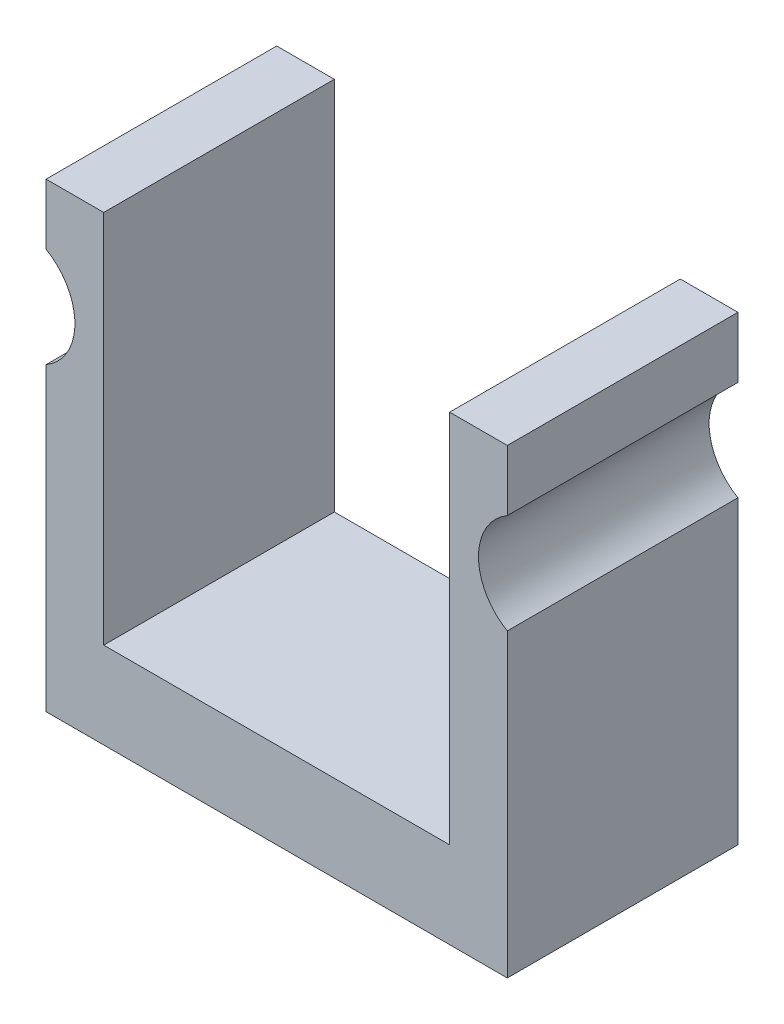
ISO-10303-21;
HEADER;
FILE_DESCRIPTION(('STEP AP214'),'2;1');
FILE_NAME('part.step','',(''),(''),'','','');
FILE_SCHEMA(('AUTOMOTIVE_DESIGN { 1 0 10303 214 1 1 1 1 }'));
ENDSEC;
DATA;
#1=APPLICATION_CONTEXT('core data for automotive mechanical design processes');
#2=APPLICATION_PROTOCOL_DEFINITION('international standard','automotive_design',2000,#1);
#3=PRODUCT_CONTEXT('',#1,'mechanical');
#4=PRODUCT('Part','Part','',(#3));
#5=PRODUCT_RELATED_PRODUCT_CATEGORY('part','',(#4));
#6=PRODUCT_DEFINITION_FORMATION('','',#4);
#7=PRODUCT_DEFINITION_CONTEXT('part definition',#1,'design');
#8=PRODUCT_DEFINITION('design','',#6,#7);
#9=PRODUCT_DEFINITION_SHAPE('','',#8);
#10=(LENGTH_UNIT() NAMED_UNIT(*) SI_UNIT(.MILLI.,.METRE.));
#11=(NAMED_UNIT(*) PLANE_ANGLE_UNIT() SI_UNIT($,.RADIAN.));
#12=(NAMED_UNIT(*) SI_UNIT($,.STERADIAN.) SOLID_ANGLE_UNIT());
#13=UNCERTAINTY_MEASURE_WITH_UNIT(LENGTH_MEASURE(1.E-05),#10,'distance_accuracy_value','');
#14=(GEOMETRIC_REPRESENTATION_CONTEXT(3) GLOBAL_UNCERTAINTY_ASSIGNED_CONTEXT((#13)) GLOBAL_UNIT_ASSIGNED_CONTEXT((#10,
#11,#12)) REPRESENTATION_CONTEXT('',''));
#15=CARTESIAN_POINT('',(0.,0.,0.));
#16=DIRECTION('',(0.,0.,1.));
#17=DIRECTION('',(1.,0.,0.));
#18=AXIS2_PLACEMENT_3D('',#15,#16,#17);
#19=CARTESIAN_POINT('',(16.7574956918045,-19.3746351202378,25.4));
#20=DIRECTION('',(-1.,0.,0.));
#21=DIRECTION('',(0.,0.,1.));
#22=AXIS2_PLACEMENT_3D('',#19,#20,#21);
#23=PLANE('',#22);
#24=DIRECTION('',(0.,1.,0.));
#25=VECTOR('',#24,1.);
#26=CARTESIAN_POINT('',(16.7574956918045,-19.3746351202378,0.));
#27=LINE('',#26,#25);
#28=CARTESIAN_POINT('',(16.7574956918045,-19.3746351202378,0.));
#29=VERTEX_POINT('',#28);
#30=CARTESIAN_POINT('',(16.7574956918045,13.734103565731,0.));
#31=VERTEX_POINT('',#30);
#32=EDGE_CURVE('E141',#29,#31,#27,.T.);
#33=ORIENTED_EDGE('',*,*,#32,.T.);
#34=DIRECTION('',(0.,0.,1.));
#35=VECTOR('',#34,1.);
#36=CARTESIAN_POINT('',(16.7574956918045,13.734103565731,0.));
#37=LINE('',#36,#35);
#38=CARTESIAN_POINT('',(16.7574956918045,13.734103565731,25.4));
#39=VERTEX_POINT('',#38);
#40=EDGE_CURVE('E48',#31,#39,#37,.T.);
#41=ORIENTED_EDGE('',*,*,#40,.T.);
#42=DIRECTION('',(0.,1.,0.));
#43=VECTOR('',#42,1.);
#44=CARTESIAN_POINT('',(16.7574956918045,-19.3746351202378,25.4));
#45=LINE('',#44,#43);
#46=CARTESIAN_POINT('',(16.7574956918045,-19.3746351202378,25.4));
#47=VERTEX_POINT('',#46);
#48=EDGE_CURVE('E195',#47,#39,#45,.T.);
#49=ORIENTED_EDGE('',*,*,#48,.F.);
#50=DIRECTION('',(0.,0.,-1.));
#51=VECTOR('',#50,1.);
#52=CARTESIAN_POINT('',(16.7574956918045,-19.3746351202378,25.4));
#53=LINE('',#52,#51);
#54=EDGE_CURVE('E176',#47,#29,#53,.T.);
#55=ORIENTED_EDGE('',*,*,#54,.T.);
#56=EDGE_LOOP('',(#33,#41,#49,#55));
#57=FACE_BOUND('',#56,.T.);
#58=ADVANCED_FACE('F33',(#57),#23,.F.);
#59=CARTESIAN_POINT('',(-34.0425043081955,-19.3746351202378,25.4));
#60=DIRECTION('',(1.,0.,0.));
#61=DIRECTION('',(0.,0.,-1.));
#62=AXIS2_PLACEMENT_3D('',#59,#60,#61);
#63=PLANE('',#62);
#64=DIRECTION('',(0.,-1.,0.));
#65=VECTOR('',#64,1.);
#66=CARTESIAN_POINT('',(-34.0425043081955,-19.3746351202378,0.));
#67=LINE('',#66,#65);
#68=CARTESIAN_POINT('',(-34.0425043081955,31.4253648797621,0.));
#69=VERTEX_POINT('',#68);
#70=CARTESIAN_POINT('',(-34.0425043081955,24.7326261937933,0.));
#71=VERTEX_POINT('',#70);
#72=EDGE_CURVE('E144',#69,#71,#67,.T.);
#73=ORIENTED_EDGE('',*,*,#72,.T.);
#74=DIRECTION('',(0.,0.,1.));
#75=VECTOR('',#74,1.);
#76=CARTESIAN_POINT('',(-34.0425043081955,24.7326261937933,0.));
#77=LINE('',#76,#75);
#78=CARTESIAN_POINT('',(-34.0425043081955,24.7326261937933,25.4));
#79=VERTEX_POINT('',#78);
#80=EDGE_CURVE('E55',#71,#79,#77,.T.);
#81=ORIENTED_EDGE('',*,*,#80,.T.);
#82=DIRECTION('',(0.,-1.,0.));
#83=VECTOR('',#82,1.);
#84=CARTESIAN_POINT('',(-34.0425043081955,-19.3746351202378,25.4));
#85=LINE('',#84,#83);
#86=CARTESIAN_POINT('',(-34.0425043081955,31.4253648797621,25.4));
#87=VERTEX_POINT('',#86);
#88=EDGE_CURVE('E223',#87,#79,#85,.T.);
#89=ORIENTED_EDGE('',*,*,#88,.F.);
#90=DIRECTION('',(0.,0.,-1.));
#91=VECTOR('',#90,1.);
#92=CARTESIAN_POINT('',(-34.0425043081955,31.4253648797621,25.4));
#93=LINE('',#92,#91);
#94=EDGE_CURVE('E158',#87,#69,#93,.T.);
#95=ORIENTED_EDGE('',*,*,#94,.T.);
#96=EDGE_LOOP('',(#73,#81,#89,#95));
#97=FACE_BOUND('',#96,.T.);
#98=ADVANCED_FACE('F212',(#97),#63,.F.);
#99=CARTESIAN_POINT('',(-34.0425043081955,13.734103565731,25.4));
#100=VERTEX_POINT('',#99);
#101=CARTESIAN_POINT('',(-34.0425043081955,-19.3746351202378,25.4));
#102=VERTEX_POINT('',#101);
#103=EDGE_CURVE('E157',#100,#102,#85,.T.);
#104=ORIENTED_EDGE('',*,*,#103,.F.);
#105=DIRECTION('',(0.,0.,1.));
#106=VECTOR('',#105,1.);
#107=CARTESIAN_POINT('',(-34.0425043081955,13.734103565731,0.));
#108=LINE('',#107,#106);
#109=CARTESIAN_POINT('',(-34.0425043081955,13.734103565731,0.));
#110=VERTEX_POINT('',#109);
#111=EDGE_CURVE('E191',#100,#110,#108,.F.);
#112=ORIENTED_EDGE('',*,*,#111,.T.);
#113=CARTESIAN_POINT('',(-34.0425043081955,-19.3746351202378,0.));
#114=VERTEX_POINT('',#113);
#115=EDGE_CURVE('E190',#110,#114,#67,.T.);
#116=ORIENTED_EDGE('',*,*,#115,.T.);
#117=DIRECTION('',(0.,0.,-1.));
#118=VECTOR('',#117,1.);
#119=CARTESIAN_POINT('',(-34.0425043081955,-19.3746351202378,25.4));
#120=LINE('',#119,#118);
#121=EDGE_CURVE('E41',#102,#114,#120,.T.);
#122=ORIENTED_EDGE('',*,*,#121,.F.);
#123=EDGE_LOOP('',(#104,#112,#116,#122));
#124=FACE_BOUND('',#123,.T.);
#125=ADVANCED_FACE('F35',(#124),#63,.F.);
#126=CARTESIAN_POINT('',(-34.0425043081955,-19.3746351202378,25.4));
#127=DIRECTION('',(0.,1.,0.));
#128=DIRECTION('',(0.,0.,1.));
#129=AXIS2_PLACEMENT_3D('',#126,#127,#128);
#130=PLANE('',#129);
#131=DIRECTION('',(1.,0.,0.));
#132=VECTOR('',#131,1.);
#133=CARTESIAN_POINT('',(-34.0425043081955,-19.3746351202378,0.));
#134=LINE('',#133,#132);
#135=EDGE_CURVE('E142',#114,#29,#134,.T.);
#136=ORIENTED_EDGE('',*,*,#135,.T.);
#137=ORIENTED_EDGE('',*,*,#54,.F.);
#138=DIRECTION('',(1.,0.,0.));
#139=VECTOR('',#138,1.);
#140=CARTESIAN_POINT('',(-34.0425043081955,-19.3746351202378,25.4));
#141=LINE('',#140,#139);
#142=EDGE_CURVE('E185',#102,#47,#141,.T.);
#143=ORIENTED_EDGE('',*,*,#142,.F.);
#144=ORIENTED_EDGE('',*,*,#121,.T.);
#145=EDGE_LOOP('',(#136,#137,#143,#144));
#146=FACE_BOUND('',#145,.T.);
#147=ADVANCED_FACE('F182',(#146),#130,.F.);
#148=CARTESIAN_POINT('',(16.7574956918045,24.7326261937933,25.4));
#149=VERTEX_POINT('',#148);
#150=CARTESIAN_POINT('',(16.7574956918045,31.4253648797621,25.4));
#151=VERTEX_POINT('',#150);
#152=EDGE_CURVE('E135',#149,#151,#45,.T.);
#153=ORIENTED_EDGE('',*,*,#152,.F.);
#154=DIRECTION('',(0.,0.,1.));
#155=VECTOR('',#154,1.);
#156=CARTESIAN_POINT('',(16.7574956918045,24.7326261937933,0.));
#157=LINE('',#156,#155);
#158=CARTESIAN_POINT('',(16.7574956918045,24.7326261937933,0.));
#159=VERTEX_POINT('',#158);
#160=EDGE_CURVE('E121',#149,#159,#157,.F.);
#161=ORIENTED_EDGE('',*,*,#160,.T.);
#162=CARTESIAN_POINT('',(16.7574956918045,31.4253648797621,0.));
#163=VERTEX_POINT('',#162);
#164=EDGE_CURVE('E133',#159,#163,#27,.T.);
#165=ORIENTED_EDGE('',*,*,#164,.T.);
#166=DIRECTION('',(0.,0.,-1.));
#167=VECTOR('',#166,1.);
#168=CARTESIAN_POINT('',(16.7574956918045,31.4253648797621,25.4));
#169=LINE('',#168,#167);
#170=EDGE_CURVE('E174',#151,#163,#169,.T.);
#171=ORIENTED_EDGE('',*,*,#170,.F.);
#172=EDGE_LOOP('',(#153,#161,#165,#171));
#173=FACE_BOUND('',#172,.T.);
#174=ADVANCED_FACE('F131',(#173),#23,.F.);
#175=CARTESIAN_POINT('',(16.7574956918045,31.4253648797621,25.4));
#176=DIRECTION('',(0.,-1.,0.));
#177=DIRECTION('',(0.,0.,-1.));
#178=AXIS2_PLACEMENT_3D('',#175,#176,#177);
#179=PLANE('',#178);
#180=DIRECTION('',(-1.,0.,0.));
#181=VECTOR('',#180,1.);
#182=CARTESIAN_POINT('',(16.7574956918045,31.4253648797621,0.));
#183=LINE('',#182,#181);
#184=CARTESIAN_POINT('',(10.4074956918045,31.4253648797621,0.));
#185=VERTEX_POINT('',#184);
#186=EDGE_CURVE('E140',#163,#185,#183,.T.);
#187=ORIENTED_EDGE('',*,*,#186,.T.);
#188=DIRECTION('',(0.,0.,-1.));
#189=VECTOR('',#188,1.);
#190=CARTESIAN_POINT('',(10.4074956918045,31.4253648797621,25.4));
#191=LINE('',#190,#189);
#192=CARTESIAN_POINT('',(10.4074956918045,31.4253648797621,25.4));
#193=VERTEX_POINT('',#192);
#194=EDGE_CURVE('E171',#193,#185,#191,.T.);
#195=ORIENTED_EDGE('',*,*,#194,.F.);
#196=DIRECTION('',(-1.,0.,0.));
#197=VECTOR('',#196,1.);
#198=CARTESIAN_POINT('',(16.7574956918045,31.4253648797621,25.4));
#199=LINE('',#198,#197);
#200=EDGE_CURVE('E197',#151,#193,#199,.T.);
#201=ORIENTED_EDGE('',*,*,#200,.F.);
#202=ORIENTED_EDGE('',*,*,#170,.T.);
#203=EDGE_LOOP('',(#187,#195,#201,#202));
#204=FACE_BOUND('',#203,.T.);
#205=ADVANCED_FACE('F231',(#204),#179,.F.);
#206=CARTESIAN_POINT('',(10.4074956918045,31.4253648797621,25.4));
#207=DIRECTION('',(1.,0.,0.));
#208=DIRECTION('',(0.,1.,0.));
#209=AXIS2_PLACEMENT_3D('',#206,#207,#208);
#210=PLANE('',#209);
#211=DIRECTION('',(0.,-1.,0.));
#212=VECTOR('',#211,1.);
#213=CARTESIAN_POINT('',(10.4074956918045,31.4253648797621,0.));
#214=LINE('',#213,#212);
#215=CARTESIAN_POINT('',(10.4074956918045,-9.84963512023785,0.));
#216=VERTEX_POINT('',#215);
#217=EDGE_CURVE('E149',#185,#216,#214,.T.);
#218=ORIENTED_EDGE('',*,*,#217,.T.);
#219=DIRECTION('',(0.,0.,-1.));
#220=VECTOR('',#219,1.);
#221=CARTESIAN_POINT('',(10.4074956918045,-9.84963512023785,25.4));
#222=LINE('',#221,#220);
#223=CARTESIAN_POINT('',(10.4074956918045,-9.84963512023785,25.4));
#224=VERTEX_POINT('',#223);
#225=EDGE_CURVE('E168',#224,#216,#222,.T.);
#226=ORIENTED_EDGE('',*,*,#225,.F.);
#227=DIRECTION('',(0.,-1.,0.));
#228=VECTOR('',#227,1.);
#229=CARTESIAN_POINT('',(10.4074956918045,31.4253648797621,25.4));
#230=LINE('',#229,#228);
#231=EDGE_CURVE('E199',#193,#224,#230,.T.);
#232=ORIENTED_EDGE('',*,*,#231,.F.);
#233=ORIENTED_EDGE('',*,*,#194,.T.);
#234=EDGE_LOOP('',(#218,#226,#232,#233));
#235=FACE_BOUND('',#234,.T.);
#236=ADVANCED_FACE('F235',(#235),#210,.F.);
#237=CARTESIAN_POINT('',(10.4074956918045,-9.84963512023785,25.4));
#238=DIRECTION('',(0.,-1.,0.));
#239=DIRECTION('',(1.,0.,0.));
#240=AXIS2_PLACEMENT_3D('',#237,#238,#239);
#241=PLANE('',#240);
#242=DIRECTION('',(-1.,0.,0.));
#243=VECTOR('',#242,1.);
#244=CARTESIAN_POINT('',(10.4074956918045,-9.84963512023785,0.));
#245=LINE('',#244,#243);
#246=CARTESIAN_POINT('',(-27.6925043081955,-9.84963512023785,0.));
#247=VERTEX_POINT('',#246);
#248=EDGE_CURVE('E151',#216,#247,#245,.T.);
#249=ORIENTED_EDGE('',*,*,#248,.T.);
#250=DIRECTION('',(0.,0.,-1.));
#251=VECTOR('',#250,1.);
#252=CARTESIAN_POINT('',(-27.6925043081955,-9.84963512023785,25.4));
#253=LINE('',#252,#251);
#254=CARTESIAN_POINT('',(-27.6925043081955,-9.84963512023785,25.4));
#255=VERTEX_POINT('',#254);
#256=EDGE_CURVE('E165',#255,#247,#253,.T.);
#257=ORIENTED_EDGE('',*,*,#256,.F.);
#258=DIRECTION('',(-1.,0.,0.));
#259=VECTOR('',#258,1.);
#260=CARTESIAN_POINT('',(10.4074956918045,-9.84963512023785,25.4));
#261=LINE('',#260,#259);
#262=EDGE_CURVE('E205',#224,#255,#261,.T.);
#263=ORIENTED_EDGE('',*,*,#262,.F.);
#264=ORIENTED_EDGE('',*,*,#225,.T.);
#265=EDGE_LOOP('',(#249,#257,#263,#264));
#266=FACE_BOUND('',#265,.T.);
#267=ADVANCED_FACE('F241',(#266),#241,.F.);
#268=CARTESIAN_POINT('',(-27.6925043081955,-9.84963512023785,25.4));
#269=DIRECTION('',(-1.,0.,0.));
#270=DIRECTION('',(0.,0.,1.));
#271=AXIS2_PLACEMENT_3D('',#268,#269,#270);
#272=PLANE('',#271);
#273=DIRECTION('',(0.,1.,0.));
#274=VECTOR('',#273,1.);
#275=CARTESIAN_POINT('',(-27.6925043081955,-9.84963512023785,0.));
#276=LINE('',#275,#274);
#277=CARTESIAN_POINT('',(-27.6925043081955,31.4253648797621,0.));
#278=VERTEX_POINT('',#277);
#279=EDGE_CURVE('E153',#247,#278,#276,.T.);
#280=ORIENTED_EDGE('',*,*,#279,.T.);
#281=DIRECTION('',(0.,0.,-1.));
#282=VECTOR('',#281,1.);
#283=CARTESIAN_POINT('',(-27.6925043081955,31.4253648797621,25.4));
#284=LINE('',#283,#282);
#285=CARTESIAN_POINT('',(-27.6925043081955,31.4253648797621,25.4));
#286=VERTEX_POINT('',#285);
#287=EDGE_CURVE('E161',#286,#278,#284,.T.);
#288=ORIENTED_EDGE('',*,*,#287,.F.);
#289=DIRECTION('',(0.,1.,0.));
#290=VECTOR('',#289,1.);
#291=CARTESIAN_POINT('',(-27.6925043081955,-9.84963512023785,25.4));
#292=LINE('',#291,#290);
#293=EDGE_CURVE('E207',#255,#286,#292,.T.);
#294=ORIENTED_EDGE('',*,*,#293,.F.);
#295=ORIENTED_EDGE('',*,*,#256,.T.);
#296=EDGE_LOOP('',(#280,#288,#294,#295));
#297=FACE_BOUND('',#296,.T.);
#298=ADVANCED_FACE('F244',(#297),#272,.F.);
#299=CARTESIAN_POINT('',(-34.0425043081955,31.4253648797621,25.4));
#300=DIRECTION('',(0.,-1.,0.));
#301=DIRECTION('',(0.,0.,-1.));
#302=AXIS2_PLACEMENT_3D('',#299,#300,#301);
#303=PLANE('',#302);
#304=DIRECTION('',(-1.,0.,0.));
#305=VECTOR('',#304,1.);
#306=CARTESIAN_POINT('',(-34.0425043081955,31.4253648797621,0.));
#307=LINE('',#306,#305);
#308=EDGE_CURVE('E155',#278,#69,#307,.T.);
#309=ORIENTED_EDGE('',*,*,#308,.T.);
#310=ORIENTED_EDGE('',*,*,#94,.F.);
#311=DIRECTION('',(-1.,0.,0.));
#312=VECTOR('',#311,1.);
#313=CARTESIAN_POINT('',(-34.0425043081955,31.4253648797621,25.4));
#314=LINE('',#313,#312);
#315=EDGE_CURVE('E162',#286,#87,#314,.T.);
#316=ORIENTED_EDGE('',*,*,#315,.F.);
#317=ORIENTED_EDGE('',*,*,#287,.T.);
#318=EDGE_LOOP('',(#309,#310,#316,#317));
#319=FACE_BOUND('',#318,.T.);
#320=ADVANCED_FACE('F247',(#319),#303,.F.);
#321=CARTESIAN_POINT('',(-34.0425043081955,31.4253648797621,25.4));
#322=DIRECTION('',(0.,0.,-1.));
#323=DIRECTION('',(-1.,0.,0.));
#324=AXIS2_PLACEMENT_3D('',#321,#322,#323);
#325=PLANE('',#324);
#326=ORIENTED_EDGE('',*,*,#48,.T.);
#327=CARTESIAN_POINT('',(19.9324956918045,19.2333648797621,25.4));
#328=DIRECTION('',(0.,0.,1.));
#329=DIRECTION('',(1.,0.,0.));
#330=AXIS2_PLACEMENT_3D('',#327,#328,#329);
#331=CIRCLE('',#330,6.35);
#332=EDGE_CURVE('E127',#149,#39,#331,.T.);
#333=ORIENTED_EDGE('',*,*,#332,.F.);
#334=ORIENTED_EDGE('',*,*,#152,.T.);
#335=ORIENTED_EDGE('',*,*,#200,.T.);
#336=ORIENTED_EDGE('',*,*,#231,.T.);
#337=ORIENTED_EDGE('',*,*,#262,.T.);
#338=ORIENTED_EDGE('',*,*,#293,.T.);
#339=ORIENTED_EDGE('',*,*,#315,.T.);
#340=ORIENTED_EDGE('',*,*,#88,.T.);
#341=CARTESIAN_POINT('',(-37.2175043081955,19.2333648797621,25.4));
#342=DIRECTION('',(0.,0.,1.));
#343=DIRECTION('',(1.,0.,0.));
#344=AXIS2_PLACEMENT_3D('',#341,#342,#343);
#345=CIRCLE('',#344,6.35);
#346=EDGE_CURVE('E220',#100,#79,#345,.T.);
#347=ORIENTED_EDGE('',*,*,#346,.F.);
#348=ORIENTED_EDGE('',*,*,#103,.T.);
#349=ORIENTED_EDGE('',*,*,#142,.T.);
#350=EDGE_LOOP('',(#326,#333,#334,#335,#336,#337,#338,#339,#340,#347,#348,#349));
#351=FACE_BOUND('',#350,.T.);
#352=ADVANCED_FACE('F222',(#351),#325,.F.);
#353=CARTESIAN_POINT('',(-34.0425043081955,31.4253648797621,0.));
#354=DIRECTION('',(0.,0.,-1.));
#355=DIRECTION('',(-1.,0.,0.));
#356=AXIS2_PLACEMENT_3D('',#353,#354,#355);
#357=PLANE('',#356);
#358=CARTESIAN_POINT('',(19.9324956918045,19.2333648797621,0.));
#359=DIRECTION('',(0.,0.,1.));
#360=DIRECTION('',(1.,0.,0.));
#361=AXIS2_PLACEMENT_3D('',#358,#359,#360);
#362=CIRCLE('',#361,6.35);
#363=EDGE_CURVE('E118',#159,#31,#362,.T.);
#364=ORIENTED_EDGE('',*,*,#363,.T.);
#365=ORIENTED_EDGE('',*,*,#32,.F.);
#366=ORIENTED_EDGE('',*,*,#135,.F.);
#367=ORIENTED_EDGE('',*,*,#115,.F.);
#368=CARTESIAN_POINT('',(-37.2175043081955,19.2333648797621,0.));
#369=DIRECTION('',(0.,0.,-1.));
#370=DIRECTION('',(-1.,0.,0.));
#371=AXIS2_PLACEMENT_3D('',#368,#369,#370);
#372=CIRCLE('',#371,6.35);
#373=EDGE_CURVE('E11',#71,#110,#372,.T.);
#374=ORIENTED_EDGE('',*,*,#373,.F.);
#375=ORIENTED_EDGE('',*,*,#72,.F.);
#376=ORIENTED_EDGE('',*,*,#308,.F.);
#377=ORIENTED_EDGE('',*,*,#279,.F.);
#378=ORIENTED_EDGE('',*,*,#248,.F.);
#379=ORIENTED_EDGE('',*,*,#217,.F.);
#380=ORIENTED_EDGE('',*,*,#186,.F.);
#381=ORIENTED_EDGE('',*,*,#164,.F.);
#382=EDGE_LOOP('',(#364,#365,#366,#367,#374,#375,#376,#377,#378,#379,#380,#381));
#383=FACE_BOUND('',#382,.T.);
#384=ADVANCED_FACE('F138',(#383),#357,.T.);
#385=CARTESIAN_POINT('',(-37.2175043081955,19.2333648797621,0.));
#386=DIRECTION('',(0.,0.,1.));
#387=DIRECTION('',(1.,0.,0.));
#388=AXIS2_PLACEMENT_3D('',#385,#386,#387);
#389=CYLINDRICAL_SURFACE('',#388,6.35);
#390=ORIENTED_EDGE('',*,*,#373,.T.);
#391=ORIENTED_EDGE('',*,*,#111,.F.);
#392=ORIENTED_EDGE('',*,*,#346,.T.);
#393=ORIENTED_EDGE('',*,*,#80,.F.);
#394=EDGE_LOOP('',(#390,#391,#392,#393));
#395=FACE_BOUND('',#394,.T.);
#396=ADVANCED_FACE('F218',(#395),#389,.F.);
#397=CARTESIAN_POINT('',(19.9324956918045,19.2333648797621,0.));
#398=DIRECTION('',(0.,0.,1.));
#399=DIRECTION('',(1.,0.,0.));
#400=AXIS2_PLACEMENT_3D('',#397,#398,#399);
#401=CYLINDRICAL_SURFACE('',#400,6.35);
#402=ORIENTED_EDGE('',*,*,#363,.F.);
#403=ORIENTED_EDGE('',*,*,#160,.F.);
#404=ORIENTED_EDGE('',*,*,#332,.T.);
#405=ORIENTED_EDGE('',*,*,#40,.F.);
#406=EDGE_LOOP('',(#402,#403,#404,#405));
#407=FACE_BOUND('',#406,.T.);
#408=ADVANCED_FACE('F120',(#407),#401,.F.);
#409=CLOSED_SHELL('',(#58,#98,#125,#147,#174,#205,#236,#267,#298,#320,#352,#384,#396,#408));
#410=MANIFOLD_SOLID_BREP('B2',#409);
#411=ADVANCED_BREP_SHAPE_REPRESENTATION('',(#18,#410),#14);
#412=SHAPE_DEFINITION_REPRESENTATION(#9,#411);
ENDSEC;
END-ISO-10303-21;
